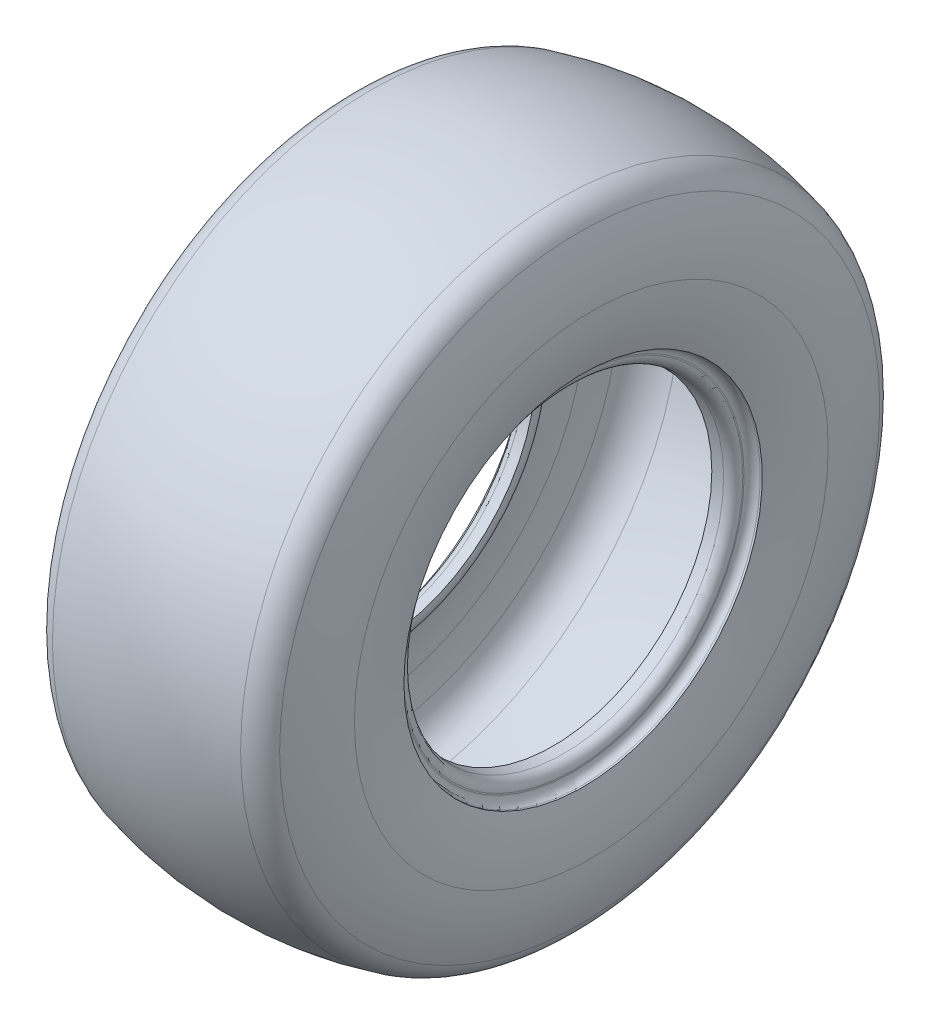
ISO-10303-21;
HEADER;
FILE_DESCRIPTION(('STEP AP214'),'2;1');
FILE_NAME('part.step','',(''),(''),'','','');
FILE_SCHEMA(('AUTOMOTIVE_DESIGN { 1 0 10303 214 1 1 1 1 }'));
ENDSEC;
DATA;
#1=APPLICATION_CONTEXT('core data for automotive mechanical design processes');
#2=APPLICATION_PROTOCOL_DEFINITION('international standard','automotive_design',2000,#1);
#3=PRODUCT_CONTEXT('',#1,'mechanical');
#4=PRODUCT('Part','Part','',(#3));
#5=PRODUCT_RELATED_PRODUCT_CATEGORY('part','',(#4));
#6=PRODUCT_DEFINITION_FORMATION('','',#4);
#7=PRODUCT_DEFINITION_CONTEXT('part definition',#1,'design');
#8=PRODUCT_DEFINITION('design','',#6,#7);
#9=PRODUCT_DEFINITION_SHAPE('','',#8);
#10=(LENGTH_UNIT() NAMED_UNIT(*) SI_UNIT(.MILLI.,.METRE.));
#11=(NAMED_UNIT(*) PLANE_ANGLE_UNIT() SI_UNIT($,.RADIAN.));
#12=(NAMED_UNIT(*) SI_UNIT($,.STERADIAN.) SOLID_ANGLE_UNIT());
#13=UNCERTAINTY_MEASURE_WITH_UNIT(LENGTH_MEASURE(1.E-05),#10,'distance_accuracy_value','');
#14=(GEOMETRIC_REPRESENTATION_CONTEXT(3) GLOBAL_UNCERTAINTY_ASSIGNED_CONTEXT((#13)) GLOBAL_UNIT_ASSIGNED_CONTEXT((#10,
#11,#12)) REPRESENTATION_CONTEXT('',''));
#15=CARTESIAN_POINT('',(0.,0.,0.));
#16=DIRECTION('',(0.,0.,1.));
#17=DIRECTION('',(1.,0.,0.));
#18=AXIS2_PLACEMENT_3D('',#15,#16,#17);
#19=CARTESIAN_POINT('',(-46.7215959888114,0.,0.));
#20=DIRECTION('',(-1.,0.,0.));
#21=DIRECTION('',(0.,0.,1.));
#22=AXIS2_PLACEMENT_3D('',#19,#20,#21);
#23=TOROIDAL_SURFACE('',#22,164.84061059421,25.4);
#24=CARTESIAN_POINT('',(-52.7173093014596,0.,0.));
#25=DIRECTION('',(-1.,0.,0.));
#26=DIRECTION('',(0.,0.,1.));
#27=AXIS2_PLACEMENT_3D('',#24,#25,#26);
#28=CIRCLE('',#27,189.522819204311);
#29=CARTESIAN_POINT('',(-52.7173093014596,0.,189.522819204311));
#30=VERTEX_POINT('',#29);
#31=EDGE_CURVE('E10',#30,#30,#28,.T.);
#32=ORIENTED_EDGE('',*,*,#31,.F.);
#33=EDGE_LOOP('',(#32));
#34=FACE_BOUND('',#33,.T.);
#35=CARTESIAN_POINT('',(-71.6746352729203,0.,0.));
#36=DIRECTION('',(-1.,0.,0.));
#37=DIRECTION('',(0.,0.,1.));
#38=AXIS2_PLACEMENT_3D('',#35,#36,#37);
#39=CIRCLE('',#38,169.58464163181);
#40=CARTESIAN_POINT('',(-71.6746352729203,0.,169.58464163181));
#41=VERTEX_POINT('',#40);
#42=EDGE_CURVE('E131',#41,#41,#39,.T.);
#43=ORIENTED_EDGE('',*,*,#42,.T.);
#44=EDGE_LOOP('',(#43));
#45=FACE_BOUND('',#44,.T.);
#46=ADVANCED_FACE('F43',(#34,#45),#23,.F.);
#47=CARTESIAN_POINT('',(0.,0.,0.));
#48=DIRECTION('',(-1.,0.,0.));
#49=DIRECTION('',(0.,0.,1.));
#50=AXIS2_PLACEMENT_3D('',#47,#48,#49);
#51=DEGENERATE_TOROIDAL_SURFACE('',#50,27.4955000000001,223.3295,.F.);
#52=CARTESIAN_POINT('',(52.7173093014595,0.,0.));
#53=DIRECTION('',(-1.,0.,0.));
#54=DIRECTION('',(0.,0.,1.));
#55=AXIS2_PLACEMENT_3D('',#52,#53,#54);
#56=CIRCLE('',#55,189.522819204311);
#57=CARTESIAN_POINT('',(52.7173093014595,0.,189.522819204311));
#58=VERTEX_POINT('',#57);
#59=EDGE_CURVE('E49',#58,#58,#56,.T.);
#60=ORIENTED_EDGE('',*,*,#59,.F.);
#61=EDGE_LOOP('',(#60));
#62=FACE_BOUND('',#61,.T.);
#63=ORIENTED_EDGE('',*,*,#31,.T.);
#64=EDGE_LOOP('',(#63));
#65=FACE_BOUND('',#64,.T.);
#66=ADVANCED_FACE('F288',(#62,#65),#51,.T.);
#67=CARTESIAN_POINT('',(46.7215959888113,0.,0.));
#68=DIRECTION('',(-1.,0.,0.));
#69=DIRECTION('',(0.,0.,1.));
#70=AXIS2_PLACEMENT_3D('',#67,#68,#69);
#71=TOROIDAL_SURFACE('',#70,164.84061059421,25.4);
#72=CARTESIAN_POINT('',(71.6746352729203,0.,0.));
#73=DIRECTION('',(-1.,0.,0.));
#74=DIRECTION('',(0.,0.,1.));
#75=AXIS2_PLACEMENT_3D('',#72,#73,#74);
#76=CIRCLE('',#75,169.58464163181);
#77=CARTESIAN_POINT('',(71.6746352729203,0.,169.58464163181));
#78=VERTEX_POINT('',#77);
#79=EDGE_CURVE('E53',#78,#78,#76,.T.);
#80=ORIENTED_EDGE('',*,*,#79,.F.);
#81=EDGE_LOOP('',(#80));
#82=FACE_BOUND('',#81,.T.);
#83=ORIENTED_EDGE('',*,*,#59,.T.);
#84=EDGE_LOOP('',(#83));
#85=FACE_BOUND('',#84,.T.);
#86=ADVANCED_FACE('F283',(#82,#85),#71,.F.);
#87=CARTESIAN_POINT('',(-32.0746348314609,0.,0.));
#88=DIRECTION('',(-1.,0.,0.));
#89=DIRECTION('',(0.,0.,1.));
#90=AXIS2_PLACEMENT_3D('',#87,#88,#89);
#91=TOROIDAL_SURFACE('',#90,149.86,105.607634831461);
#92=CARTESIAN_POINT('',(73.533,0.,0.));
#93=DIRECTION('',(-1.,0.,0.));
#94=DIRECTION('',(0.,0.,1.));
#95=AXIS2_PLACEMENT_3D('',#92,#93,#94);
#96=CIRCLE('',#95,149.86);
#97=CARTESIAN_POINT('',(73.533,0.,149.86));
#98=VERTEX_POINT('',#97);
#99=EDGE_CURVE('E57',#98,#98,#96,.T.);
#100=ORIENTED_EDGE('',*,*,#99,.F.);
#101=EDGE_LOOP('',(#100));
#102=FACE_BOUND('',#101,.T.);
#103=ORIENTED_EDGE('',*,*,#79,.T.);
#104=EDGE_LOOP('',(#103));
#105=FACE_BOUND('',#104,.T.);
#106=ADVANCED_FACE('F277',(#102,#105),#91,.F.);
#107=CARTESIAN_POINT('',(-50.8259575609755,0.,0.));
#108=DIRECTION('',(-1.,0.,0.));
#109=DIRECTION('',(0.,0.,1.));
#110=AXIS2_PLACEMENT_3D('',#107,#108,#109);
#111=TOROIDAL_SURFACE('',#110,149.86,124.358957560975);
#112=CARTESIAN_POINT('',(71.1013345389878,0.,0.));
#113=DIRECTION('',(-1.,0.,0.));
#114=DIRECTION('',(0.,0.,1.));
#115=AXIS2_PLACEMENT_3D('',#112,#113,#114);
#116=CIRCLE('',#115,125.387857330778);
#117=CARTESIAN_POINT('',(71.1013345389878,0.,125.387857330778));
#118=VERTEX_POINT('',#117);
#119=EDGE_CURVE('E62',#118,#118,#116,.T.);
#120=ORIENTED_EDGE('',*,*,#119,.F.);
#121=EDGE_LOOP('',(#120));
#122=FACE_BOUND('',#121,.T.);
#123=ORIENTED_EDGE('',*,*,#99,.T.);
#124=EDGE_LOOP('',(#123));
#125=FACE_BOUND('',#124,.T.);
#126=ADVANCED_FACE('F271',(#122,#125),#111,.F.);
#127=CARTESIAN_POINT('',(52.4238306417279,0.,0.));
#128=DIRECTION('',(-1.,0.,0.));
#129=DIRECTION('',(0.,0.,1.));
#130=AXIS2_PLACEMENT_3D('',#127,#128,#129);
#131=TOROIDAL_SURFACE('',#130,129.136636887893,19.05);
#132=CARTESIAN_POINT('',(61.9505760088435,0.,0.));
#133=DIRECTION('',(-1.,0.,0.));
#134=DIRECTION('',(0.,0.,1.));
#135=AXIS2_PLACEMENT_3D('',#132,#133,#134);
#136=CIRCLE('',#135,112.639860757081);
#137=CARTESIAN_POINT('',(61.9505760088435,0.,112.639860757081));
#138=VERTEX_POINT('',#137);
#139=EDGE_CURVE('E65',#138,#138,#136,.T.);
#140=ORIENTED_EDGE('',*,*,#139,.F.);
#141=EDGE_LOOP('',(#140));
#142=FACE_BOUND('',#141,.T.);
#143=ORIENTED_EDGE('',*,*,#119,.T.);
#144=EDGE_LOOP('',(#143));
#145=FACE_BOUND('',#144,.T.);
#146=ADVANCED_FACE('F265',(#142,#145),#131,.F.);
#147=CARTESIAN_POINT('',(68.326,0.,0.));
#148=DIRECTION('',(-1.,0.,0.));
#149=DIRECTION('',(0.,0.,1.));
#150=AXIS2_PLACEMENT_3D('',#147,#148,#149);
#151=TOROIDAL_SURFACE('',#150,101.6,12.7485119368005);
#152=CARTESIAN_POINT('',(55.626,0.,0.));
#153=DIRECTION('',(-1.,0.,0.));
#154=DIRECTION('',(0.,0.,1.));
#155=AXIS2_PLACEMENT_3D('',#152,#153,#154);
#156=CIRCLE('',#155,100.488893973221);
#157=CARTESIAN_POINT('',(55.626,0.,100.488893973221));
#158=VERTEX_POINT('',#157);
#159=EDGE_CURVE('E68',#158,#158,#156,.T.);
#160=ORIENTED_EDGE('',*,*,#159,.F.);
#161=EDGE_LOOP('',(#160));
#162=FACE_BOUND('',#161,.T.);
#163=ORIENTED_EDGE('',*,*,#139,.T.);
#164=EDGE_LOOP('',(#163));
#165=FACE_BOUND('',#164,.T.);
#166=ADVANCED_FACE('F259',(#162,#165),#151,.T.);
#167=CARTESIAN_POINT('',(55.626,0.,0.));
#168=DIRECTION('',(1.,0.,0.));
#169=DIRECTION('',(0.,0.,-1.));
#170=AXIS2_PLACEMENT_3D('',#167,#168,#169);
#171=CONICAL_SURFACE('',#170,100.488893973221,0.0872664625997176);
#172=CARTESIAN_POINT('',(62.5294389664476,0.,0.));
#173=DIRECTION('',(-1.,0.,0.));
#174=DIRECTION('',(0.,0.,1.));
#175=AXIS2_PLACEMENT_3D('',#172,#173,#174);
#176=CIRCLE('',#175,101.092866622128);
#177=CARTESIAN_POINT('',(62.5294389664476,0.,101.092866622128));
#178=VERTEX_POINT('',#177);
#179=EDGE_CURVE('E71',#178,#178,#176,.T.);
#180=ORIENTED_EDGE('',*,*,#179,.F.);
#181=EDGE_LOOP('',(#180));
#182=FACE_BOUND('',#181,.T.);
#183=ORIENTED_EDGE('',*,*,#159,.T.);
#184=EDGE_LOOP('',(#183));
#185=FACE_BOUND('',#184,.T.);
#186=ADVANCED_FACE('F253',(#182,#185),#171,.F.);
#187=CARTESIAN_POINT('',(61.976,0.,0.));
#188=DIRECTION('',(-1.,0.,0.));
#189=DIRECTION('',(0.,0.,1.));
#190=AXIS2_PLACEMENT_3D('',#187,#188,#189);
#191=TOROIDAL_SURFACE('',#190,107.418702955011,6.34999999999999);
#192=CARTESIAN_POINT('',(68.326,0.,0.));
#193=DIRECTION('',(-1.,0.,0.));
#194=DIRECTION('',(0.,0.,1.));
#195=AXIS2_PLACEMENT_3D('',#192,#193,#194);
#196=CIRCLE('',#195,107.418702955011);
#197=CARTESIAN_POINT('',(68.326,0.,107.418702955011));
#198=VERTEX_POINT('',#197);
#199=EDGE_CURVE('E74',#198,#198,#196,.T.);
#200=ORIENTED_EDGE('',*,*,#199,.F.);
#201=EDGE_LOOP('',(#200));
#202=FACE_BOUND('',#201,.T.);
#203=ORIENTED_EDGE('',*,*,#179,.T.);
#204=EDGE_LOOP('',(#203));
#205=FACE_BOUND('',#204,.T.);
#206=ADVANCED_FACE('F247',(#202,#205),#191,.T.);
#207=CARTESIAN_POINT('',(68.326,107.418702955011,0.));
#208=DIRECTION('',(-1.,0.,0.));
#209=DIRECTION('',(0.,0.,1.));
#210=AXIS2_PLACEMENT_3D('',#207,#208,#209);
#211=PLANE('',#210);
#212=CARTESIAN_POINT('',(68.326,0.,0.));
#213=DIRECTION('',(-1.,0.,0.));
#214=DIRECTION('',(0.,0.,1.));
#215=AXIS2_PLACEMENT_3D('',#212,#213,#214);
#216=CIRCLE('',#215,108.2548);
#217=CARTESIAN_POINT('',(68.326,0.,108.2548));
#218=VERTEX_POINT('',#217);
#219=EDGE_CURVE('E77',#218,#218,#216,.T.);
#220=ORIENTED_EDGE('',*,*,#219,.F.);
#221=EDGE_LOOP('',(#220));
#222=FACE_BOUND('',#221,.T.);
#223=ORIENTED_EDGE('',*,*,#199,.T.);
#224=EDGE_LOOP('',(#223));
#225=FACE_BOUND('',#224,.T.);
#226=ADVANCED_FACE('F241',(#222,#225),#211,.F.);
#227=CARTESIAN_POINT('',(73.406,0.,0.));
#228=DIRECTION('',(-1.,0.,0.));
#229=DIRECTION('',(0.,0.,1.));
#230=AXIS2_PLACEMENT_3D('',#227,#228,#229);
#231=TOROIDAL_SURFACE('',#230,108.2548,5.08000000000002);
#232=CARTESIAN_POINT('',(73.406,0.,0.));
#233=DIRECTION('',(-1.,0.,0.));
#234=DIRECTION('',(0.,0.,1.));
#235=AXIS2_PLACEMENT_3D('',#232,#233,#234);
#236=CIRCLE('',#235,113.3348);
#237=CARTESIAN_POINT('',(73.406,0.,113.3348));
#238=VERTEX_POINT('',#237);
#239=EDGE_CURVE('E80',#238,#238,#236,.T.);
#240=ORIENTED_EDGE('',*,*,#239,.F.);
#241=EDGE_LOOP('',(#240));
#242=FACE_BOUND('',#241,.T.);
#243=ORIENTED_EDGE('',*,*,#219,.T.);
#244=EDGE_LOOP('',(#243));
#245=FACE_BOUND('',#244,.T.);
#246=ADVANCED_FACE('F235',(#242,#245),#231,.F.);
#247=CARTESIAN_POINT('',(-88.99,0.,0.));
#248=DIRECTION('',(-1.,0.,0.));
#249=DIRECTION('',(0.,0.,1.));
#250=AXIS2_PLACEMENT_3D('',#247,#248,#249);
#251=CYLINDRICAL_SURFACE('',#250,113.3348);
#252=CARTESIAN_POINT('',(74.676,0.,0.));
#253=DIRECTION('',(-1.,0.,0.));
#254=DIRECTION('',(0.,0.,1.));
#255=AXIS2_PLACEMENT_3D('',#252,#253,#254);
#256=CIRCLE('',#255,113.3348);
#257=CARTESIAN_POINT('',(74.676,0.,113.3348));
#258=VERTEX_POINT('',#257);
#259=EDGE_CURVE('E83',#258,#258,#256,.T.);
#260=ORIENTED_EDGE('',*,*,#259,.F.);
#261=EDGE_LOOP('',(#260));
#262=FACE_BOUND('',#261,.T.);
#263=ORIENTED_EDGE('',*,*,#239,.T.);
#264=EDGE_LOOP('',(#263));
#265=FACE_BOUND('',#264,.T.);
#266=ADVANCED_FACE('F229',(#262,#265),#251,.F.);
#267=CARTESIAN_POINT('',(-50.8259575609755,0.,0.));
#268=DIRECTION('',(-1.,0.,0.));
#269=DIRECTION('',(0.,0.,1.));
#270=AXIS2_PLACEMENT_3D('',#267,#268,#269);
#271=TOROIDAL_SURFACE('',#270,149.86,130.708957560975);
#272=CARTESIAN_POINT('',(79.883,0.,0.));
#273=DIRECTION('',(-1.,0.,0.));
#274=DIRECTION('',(0.,0.,1.));
#275=AXIS2_PLACEMENT_3D('',#272,#273,#274);
#276=CIRCLE('',#275,149.86);
#277=CARTESIAN_POINT('',(79.883,0.,149.86));
#278=VERTEX_POINT('',#277);
#279=EDGE_CURVE('E86',#278,#278,#276,.T.);
#280=ORIENTED_EDGE('',*,*,#279,.F.);
#281=EDGE_LOOP('',(#280));
#282=FACE_BOUND('',#281,.T.);
#283=ORIENTED_EDGE('',*,*,#259,.T.);
#284=EDGE_LOOP('',(#283));
#285=FACE_BOUND('',#284,.T.);
#286=ADVANCED_FACE('F223',(#282,#285),#271,.T.);
#287=CARTESIAN_POINT('',(-32.0746348314609,0.,0.));
#288=DIRECTION('',(-1.,0.,0.));
#289=DIRECTION('',(0.,0.,1.));
#290=AXIS2_PLACEMENT_3D('',#287,#288,#289);
#291=TOROIDAL_SURFACE('',#290,149.86,111.957634831461);
#292=CARTESIAN_POINT('',(72.5207923601637,0.,0.));
#293=DIRECTION('',(-1.,0.,0.));
#294=DIRECTION('',(0.,0.,1.));
#295=AXIS2_PLACEMENT_3D('',#292,#293,#294);
#296=CIRCLE('',#295,189.78879421741);
#297=CARTESIAN_POINT('',(72.5207923601637,0.,189.78879421741));
#298=VERTEX_POINT('',#297);
#299=EDGE_CURVE('E89',#298,#298,#296,.T.);
#300=ORIENTED_EDGE('',*,*,#299,.F.);
#301=EDGE_LOOP('',(#300));
#302=FACE_BOUND('',#301,.T.);
#303=ORIENTED_EDGE('',*,*,#279,.T.);
#304=EDGE_LOOP('',(#303));
#305=FACE_BOUND('',#304,.T.);
#306=ADVANCED_FACE('F217',(#302,#305),#291,.T.);
#307=CARTESIAN_POINT('',(54.7234988482028,0.,0.));
#308=DIRECTION('',(-1.,0.,0.));
#309=DIRECTION('',(0.,0.,1.));
#310=AXIS2_PLACEMENT_3D('',#307,#308,#309);
#311=TOROIDAL_SURFACE('',#310,182.994764216806,19.05);
#312=CARTESIAN_POINT('',(59.5167980173884,0.,0.));
#313=DIRECTION('',(-1.,0.,0.));
#314=DIRECTION('',(0.,0.,1.));
#315=AXIS2_PLACEMENT_3D('',#312,#313,#314);
#316=CIRCLE('',#315,201.431867651855);
#317=CARTESIAN_POINT('',(59.5167980173884,0.,201.431867651855));
#318=VERTEX_POINT('',#317);
#319=EDGE_CURVE('E92',#318,#318,#316,.T.);
#320=ORIENTED_EDGE('',*,*,#319,.F.);
#321=EDGE_LOOP('',(#320));
#322=FACE_BOUND('',#321,.T.);
#323=ORIENTED_EDGE('',*,*,#299,.T.);
#324=EDGE_LOOP('',(#323));
#325=FACE_BOUND('',#324,.T.);
#326=ADVANCED_FACE('F211',(#322,#325),#311,.T.);
#327=CARTESIAN_POINT('',(0.,0.,0.));
#328=DIRECTION('',(-1.,0.,0.));
#329=DIRECTION('',(0.,0.,1.));
#330=AXIS2_PLACEMENT_3D('',#327,#328,#329);
#331=DEGENERATE_TOROIDAL_SURFACE('',#330,27.4955000000001,236.5375,.F.);
#332=CARTESIAN_POINT('',(-59.5167980173884,0.,0.));
#333=DIRECTION('',(-1.,0.,0.));
#334=DIRECTION('',(0.,0.,1.));
#335=AXIS2_PLACEMENT_3D('',#332,#333,#334);
#336=CIRCLE('',#335,201.431867651855);
#337=CARTESIAN_POINT('',(-59.5167980173884,0.,201.431867651855));
#338=VERTEX_POINT('',#337);
#339=EDGE_CURVE('E95',#338,#338,#336,.T.);
#340=ORIENTED_EDGE('',*,*,#339,.F.);
#341=EDGE_LOOP('',(#340));
#342=FACE_BOUND('',#341,.T.);
#343=ORIENTED_EDGE('',*,*,#319,.T.);
#344=EDGE_LOOP('',(#343));
#345=FACE_BOUND('',#344,.T.);
#346=ADVANCED_FACE('F205',(#342,#345),#331,.F.);
#347=CARTESIAN_POINT('',(-54.7234988482028,0.,0.));
#348=DIRECTION('',(-1.,0.,0.));
#349=DIRECTION('',(0.,0.,1.));
#350=AXIS2_PLACEMENT_3D('',#347,#348,#349);
#351=TOROIDAL_SURFACE('',#350,182.994764216806,19.05);
#352=CARTESIAN_POINT('',(-72.5207923601637,0.,0.));
#353=DIRECTION('',(-1.,0.,0.));
#354=DIRECTION('',(0.,0.,1.));
#355=AXIS2_PLACEMENT_3D('',#352,#353,#354);
#356=CIRCLE('',#355,189.78879421741);
#357=CARTESIAN_POINT('',(-72.5207923601637,0.,189.78879421741));
#358=VERTEX_POINT('',#357);
#359=EDGE_CURVE('E98',#358,#358,#356,.T.);
#360=ORIENTED_EDGE('',*,*,#359,.F.);
#361=EDGE_LOOP('',(#360));
#362=FACE_BOUND('',#361,.T.);
#363=ORIENTED_EDGE('',*,*,#339,.T.);
#364=EDGE_LOOP('',(#363));
#365=FACE_BOUND('',#364,.T.);
#366=ADVANCED_FACE('F199',(#362,#365),#351,.T.);
#367=CARTESIAN_POINT('',(32.0746348314609,0.,0.));
#368=DIRECTION('',(-1.,0.,0.));
#369=DIRECTION('',(0.,0.,1.));
#370=AXIS2_PLACEMENT_3D('',#367,#368,#369);
#371=TOROIDAL_SURFACE('',#370,149.86,111.957634831461);
#372=CARTESIAN_POINT('',(-79.883,0.,0.));
#373=DIRECTION('',(-1.,0.,0.));
#374=DIRECTION('',(0.,0.,1.));
#375=AXIS2_PLACEMENT_3D('',#372,#373,#374);
#376=CIRCLE('',#375,149.86);
#377=CARTESIAN_POINT('',(-79.883,0.,149.86));
#378=VERTEX_POINT('',#377);
#379=EDGE_CURVE('E101',#378,#378,#376,.T.);
#380=ORIENTED_EDGE('',*,*,#379,.F.);
#381=EDGE_LOOP('',(#380));
#382=FACE_BOUND('',#381,.T.);
#383=ORIENTED_EDGE('',*,*,#359,.T.);
#384=EDGE_LOOP('',(#383));
#385=FACE_BOUND('',#384,.T.);
#386=ADVANCED_FACE('F193',(#382,#385),#371,.T.);
#387=CARTESIAN_POINT('',(50.8259575609755,0.,0.));
#388=DIRECTION('',(-1.,0.,0.));
#389=DIRECTION('',(0.,0.,1.));
#390=AXIS2_PLACEMENT_3D('',#387,#388,#389);
#391=TOROIDAL_SURFACE('',#390,149.86,130.708957560975);
#392=CARTESIAN_POINT('',(-74.676,0.,0.));
#393=DIRECTION('',(-1.,0.,0.));
#394=DIRECTION('',(0.,0.,1.));
#395=AXIS2_PLACEMENT_3D('',#392,#393,#394);
#396=CIRCLE('',#395,113.3348);
#397=CARTESIAN_POINT('',(-74.676,0.,113.3348));
#398=VERTEX_POINT('',#397);
#399=EDGE_CURVE('E104',#398,#398,#396,.T.);
#400=ORIENTED_EDGE('',*,*,#399,.F.);
#401=EDGE_LOOP('',(#400));
#402=FACE_BOUND('',#401,.T.);
#403=ORIENTED_EDGE('',*,*,#379,.T.);
#404=EDGE_LOOP('',(#403));
#405=FACE_BOUND('',#404,.T.);
#406=ADVANCED_FACE('F187',(#402,#405),#391,.T.);
#407=CARTESIAN_POINT('',(-88.99,0.,0.));
#408=DIRECTION('',(-1.,0.,0.));
#409=DIRECTION('',(0.,0.,1.));
#410=AXIS2_PLACEMENT_3D('',#407,#408,#409);
#411=CYLINDRICAL_SURFACE('',#410,113.3348);
#412=CARTESIAN_POINT('',(-73.406,0.,0.));
#413=DIRECTION('',(-1.,0.,0.));
#414=DIRECTION('',(0.,0.,1.));
#415=AXIS2_PLACEMENT_3D('',#412,#413,#414);
#416=CIRCLE('',#415,113.3348);
#417=CARTESIAN_POINT('',(-73.406,0.,113.3348));
#418=VERTEX_POINT('',#417);
#419=EDGE_CURVE('E107',#418,#418,#416,.T.);
#420=ORIENTED_EDGE('',*,*,#419,.F.);
#421=EDGE_LOOP('',(#420));
#422=FACE_BOUND('',#421,.T.);
#423=ORIENTED_EDGE('',*,*,#399,.T.);
#424=EDGE_LOOP('',(#423));
#425=FACE_BOUND('',#424,.T.);
#426=ADVANCED_FACE('F181',(#422,#425),#411,.F.);
#427=CARTESIAN_POINT('',(-73.406,0.,0.));
#428=DIRECTION('',(-1.,0.,0.));
#429=DIRECTION('',(0.,0.,1.));
#430=AXIS2_PLACEMENT_3D('',#427,#428,#429);
#431=TOROIDAL_SURFACE('',#430,108.2548,5.08000000000002);
#432=CARTESIAN_POINT('',(-68.326,0.,0.));
#433=DIRECTION('',(-1.,0.,0.));
#434=DIRECTION('',(0.,0.,1.));
#435=AXIS2_PLACEMENT_3D('',#432,#433,#434);
#436=CIRCLE('',#435,108.2548);
#437=CARTESIAN_POINT('',(-68.326,0.,108.2548));
#438=VERTEX_POINT('',#437);
#439=EDGE_CURVE('E110',#438,#438,#436,.T.);
#440=ORIENTED_EDGE('',*,*,#439,.F.);
#441=EDGE_LOOP('',(#440));
#442=FACE_BOUND('',#441,.T.);
#443=ORIENTED_EDGE('',*,*,#419,.T.);
#444=EDGE_LOOP('',(#443));
#445=FACE_BOUND('',#444,.T.);
#446=ADVANCED_FACE('F175',(#442,#445),#431,.F.);
#447=CARTESIAN_POINT('',(-68.326,107.418702955011,0.));
#448=DIRECTION('',(1.,0.,0.));
#449=DIRECTION('',(0.,0.,-1.));
#450=AXIS2_PLACEMENT_3D('',#447,#448,#449);
#451=PLANE('',#450);
#452=CARTESIAN_POINT('',(-68.326,0.,0.));
#453=DIRECTION('',(-1.,0.,0.));
#454=DIRECTION('',(0.,0.,1.));
#455=AXIS2_PLACEMENT_3D('',#452,#453,#454);
#456=CIRCLE('',#455,107.418702955011);
#457=CARTESIAN_POINT('',(-68.326,0.,107.418702955011));
#458=VERTEX_POINT('',#457);
#459=EDGE_CURVE('E113',#458,#458,#456,.T.);
#460=ORIENTED_EDGE('',*,*,#459,.F.);
#461=EDGE_LOOP('',(#460));
#462=FACE_BOUND('',#461,.T.);
#463=ORIENTED_EDGE('',*,*,#439,.T.);
#464=EDGE_LOOP('',(#463));
#465=FACE_BOUND('',#464,.T.);
#466=ADVANCED_FACE('F169',(#462,#465),#451,.F.);
#467=CARTESIAN_POINT('',(-61.976,0.,0.));
#468=DIRECTION('',(-1.,0.,0.));
#469=DIRECTION('',(0.,0.,1.));
#470=AXIS2_PLACEMENT_3D('',#467,#468,#469);
#471=TOROIDAL_SURFACE('',#470,107.418702955011,6.35);
#472=CARTESIAN_POINT('',(-62.5294389664476,0.,0.));
#473=DIRECTION('',(-1.,0.,0.));
#474=DIRECTION('',(0.,0.,1.));
#475=AXIS2_PLACEMENT_3D('',#472,#473,#474);
#476=CIRCLE('',#475,101.092866622128);
#477=CARTESIAN_POINT('',(-62.5294389664476,0.,101.092866622128));
#478=VERTEX_POINT('',#477);
#479=EDGE_CURVE('E116',#478,#478,#476,.T.);
#480=ORIENTED_EDGE('',*,*,#479,.F.);
#481=EDGE_LOOP('',(#480));
#482=FACE_BOUND('',#481,.T.);
#483=ORIENTED_EDGE('',*,*,#459,.T.);
#484=EDGE_LOOP('',(#483));
#485=FACE_BOUND('',#484,.T.);
#486=ADVANCED_FACE('F163',(#482,#485),#471,.T.);
#487=CARTESIAN_POINT('',(-62.5294389664476,0.,0.));
#488=DIRECTION('',(-1.,0.,0.));
#489=DIRECTION('',(0.,0.,1.));
#490=AXIS2_PLACEMENT_3D('',#487,#488,#489);
#491=CONICAL_SURFACE('',#490,101.092866622128,0.0872664625997176);
#492=CARTESIAN_POINT('',(-55.626,0.,0.));
#493=DIRECTION('',(-1.,0.,0.));
#494=DIRECTION('',(0.,0.,1.));
#495=AXIS2_PLACEMENT_3D('',#492,#493,#494);
#496=CIRCLE('',#495,100.488893973221);
#497=CARTESIAN_POINT('',(-55.626,0.,100.488893973221));
#498=VERTEX_POINT('',#497);
#499=EDGE_CURVE('E119',#498,#498,#496,.T.);
#500=ORIENTED_EDGE('',*,*,#499,.F.);
#501=EDGE_LOOP('',(#500));
#502=FACE_BOUND('',#501,.T.);
#503=ORIENTED_EDGE('',*,*,#479,.T.);
#504=EDGE_LOOP('',(#503));
#505=FACE_BOUND('',#504,.T.);
#506=ADVANCED_FACE('F157',(#502,#505),#491,.F.);
#507=CARTESIAN_POINT('',(-68.326,0.,0.));
#508=DIRECTION('',(-1.,0.,0.));
#509=DIRECTION('',(0.,0.,1.));
#510=AXIS2_PLACEMENT_3D('',#507,#508,#509);
#511=TOROIDAL_SURFACE('',#510,101.6,12.7485119368005);
#512=CARTESIAN_POINT('',(-61.9505760088434,0.,0.));
#513=DIRECTION('',(-1.,0.,0.));
#514=DIRECTION('',(0.,0.,1.));
#515=AXIS2_PLACEMENT_3D('',#512,#513,#514);
#516=CIRCLE('',#515,112.639860757081);
#517=CARTESIAN_POINT('',(-61.9505760088434,0.,112.639860757081));
#518=VERTEX_POINT('',#517);
#519=EDGE_CURVE('E122',#518,#518,#516,.T.);
#520=ORIENTED_EDGE('',*,*,#519,.F.);
#521=EDGE_LOOP('',(#520));
#522=FACE_BOUND('',#521,.T.);
#523=ORIENTED_EDGE('',*,*,#499,.T.);
#524=EDGE_LOOP('',(#523));
#525=FACE_BOUND('',#524,.T.);
#526=ADVANCED_FACE('F151',(#522,#525),#511,.T.);
#527=CARTESIAN_POINT('',(-52.4238306417279,0.,0.));
#528=DIRECTION('',(-1.,0.,0.));
#529=DIRECTION('',(0.,0.,1.));
#530=AXIS2_PLACEMENT_3D('',#527,#528,#529);
#531=TOROIDAL_SURFACE('',#530,129.136636887893,19.05);
#532=CARTESIAN_POINT('',(-71.1013345389878,0.,0.));
#533=DIRECTION('',(-1.,0.,0.));
#534=DIRECTION('',(0.,0.,1.));
#535=AXIS2_PLACEMENT_3D('',#532,#533,#534);
#536=CIRCLE('',#535,125.387857330779);
#537=CARTESIAN_POINT('',(-71.1013345389878,0.,125.387857330779));
#538=VERTEX_POINT('',#537);
#539=EDGE_CURVE('E125',#538,#538,#536,.T.);
#540=ORIENTED_EDGE('',*,*,#539,.F.);
#541=EDGE_LOOP('',(#540));
#542=FACE_BOUND('',#541,.T.);
#543=ORIENTED_EDGE('',*,*,#519,.T.);
#544=EDGE_LOOP('',(#543));
#545=FACE_BOUND('',#544,.T.);
#546=ADVANCED_FACE('F145',(#542,#545),#531,.F.);
#547=CARTESIAN_POINT('',(50.8259575609755,0.,0.));
#548=DIRECTION('',(-1.,0.,0.));
#549=DIRECTION('',(0.,0.,1.));
#550=AXIS2_PLACEMENT_3D('',#547,#548,#549);
#551=TOROIDAL_SURFACE('',#550,149.86,124.358957560975);
#552=CARTESIAN_POINT('',(-73.533,0.,0.));
#553=DIRECTION('',(-1.,0.,0.));
#554=DIRECTION('',(0.,0.,1.));
#555=AXIS2_PLACEMENT_3D('',#552,#553,#554);
#556=CIRCLE('',#555,149.86);
#557=CARTESIAN_POINT('',(-73.533,0.,149.86));
#558=VERTEX_POINT('',#557);
#559=EDGE_CURVE('E128',#558,#558,#556,.T.);
#560=ORIENTED_EDGE('',*,*,#559,.F.);
#561=EDGE_LOOP('',(#560));
#562=FACE_BOUND('',#561,.T.);
#563=ORIENTED_EDGE('',*,*,#539,.T.);
#564=EDGE_LOOP('',(#563));
#565=FACE_BOUND('',#564,.T.);
#566=ADVANCED_FACE('F139',(#562,#565),#551,.F.);
#567=CARTESIAN_POINT('',(32.0746348314609,0.,0.));
#568=DIRECTION('',(-1.,0.,0.));
#569=DIRECTION('',(0.,0.,1.));
#570=AXIS2_PLACEMENT_3D('',#567,#568,#569);
#571=TOROIDAL_SURFACE('',#570,149.86,105.607634831461);
#572=ORIENTED_EDGE('',*,*,#42,.F.);
#573=EDGE_LOOP('',(#572));
#574=FACE_BOUND('',#573,.T.);
#575=ORIENTED_EDGE('',*,*,#559,.T.);
#576=EDGE_LOOP('',(#575));
#577=FACE_BOUND('',#576,.T.);
#578=ADVANCED_FACE('F136',(#574,#577),#571,.F.);
#579=CLOSED_SHELL('',(#46,#66,#86,#106,#126,#146,#166,#186,#206,#226,#246,#266,#286,#306,#326,
#346,#366,#386,#406,#426,#446,#466,#486,#506,#526,#546,#566,#578));
#580=MANIFOLD_SOLID_BREP('B2',#579);
#581=ADVANCED_BREP_SHAPE_REPRESENTATION('',(#18,#580),#14);
#582=SHAPE_DEFINITION_REPRESENTATION(#9,#581);
ENDSEC;
END-ISO-10303-21;
